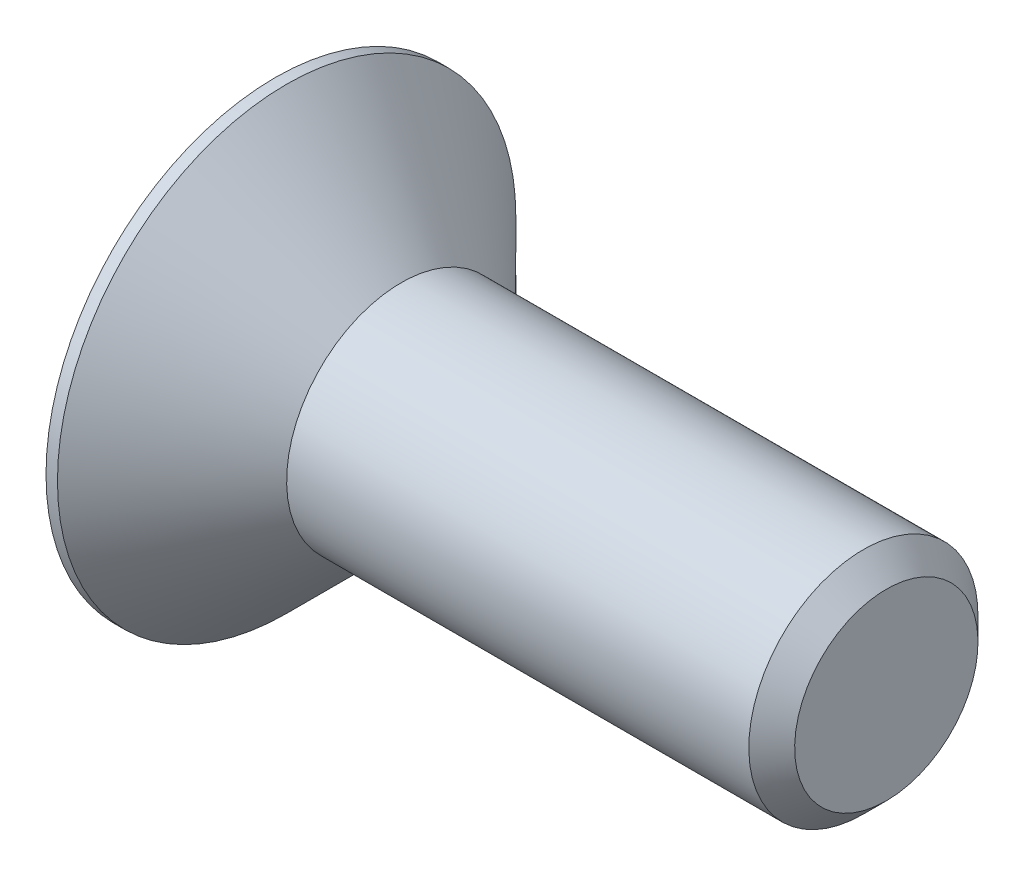
ISO-10303-21;
HEADER;
FILE_DESCRIPTION(('STEP AP214'),'2;1');
FILE_NAME('part.step','',(''),(''),'','','');
FILE_SCHEMA(('AUTOMOTIVE_DESIGN { 1 0 10303 214 1 1 1 1 }'));
ENDSEC;
DATA;
#1=APPLICATION_CONTEXT('core data for automotive mechanical design processes');
#2=APPLICATION_PROTOCOL_DEFINITION('international standard','automotive_design',2000,#1);
#3=PRODUCT_CONTEXT('',#1,'mechanical');
#4=PRODUCT('Part','Part','',(#3));
#5=PRODUCT_RELATED_PRODUCT_CATEGORY('part','',(#4));
#6=PRODUCT_DEFINITION_FORMATION('','',#4);
#7=PRODUCT_DEFINITION_CONTEXT('part definition',#1,'design');
#8=PRODUCT_DEFINITION('design','',#6,#7);
#9=PRODUCT_DEFINITION_SHAPE('','',#8);
#10=(LENGTH_UNIT() NAMED_UNIT(*) SI_UNIT(.MILLI.,.METRE.));
#11=(NAMED_UNIT(*) PLANE_ANGLE_UNIT() SI_UNIT($,.RADIAN.));
#12=(NAMED_UNIT(*) SI_UNIT($,.STERADIAN.) SOLID_ANGLE_UNIT());
#13=UNCERTAINTY_MEASURE_WITH_UNIT(LENGTH_MEASURE(1.E-05),#10,'distance_accuracy_value','');
#14=(GEOMETRIC_REPRESENTATION_CONTEXT(3) GLOBAL_UNCERTAINTY_ASSIGNED_CONTEXT((#13)) GLOBAL_UNIT_ASSIGNED_CONTEXT((#10,
#11,#12)) REPRESENTATION_CONTEXT('',''));
#15=CARTESIAN_POINT('',(0.,0.,0.));
#16=DIRECTION('',(0.,0.,1.));
#17=DIRECTION('',(1.,0.,0.));
#18=AXIS2_PLACEMENT_3D('',#15,#16,#17);
#19=CARTESIAN_POINT('',(1.65000000000121,32.4759533496223,18.7500003484413));
#20=DIRECTION('',(-1.,0.,0.));
#21=DIRECTION('',(0.,-1.,0.));
#22=AXIS2_PLACEMENT_3D('',#19,#20,#21);
#23=PLANE('',#22);
#24=DIRECTION('',(0.,0.5,-0.866025403784439));
#25=VECTOR('',#24,1.);
#26=CARTESIAN_POINT('',(1.65000000000113,30.7439025420534,17.7500003484413));
#27=LINE('',#26,#25);
#28=CARTESIAN_POINT('',(1.65000000000117,31.321252811243,16.7500003484413));
#29=VERTEX_POINT('',#28);
#30=CARTESIAN_POINT('',(1.65000000000106,30.1665522728638,18.7500003484413));
#31=VERTEX_POINT('',#30);
#32=EDGE_CURVE('E83',#29,#31,#27,.F.);
#33=ORIENTED_EDGE('',*,*,#32,.T.);
#34=DIRECTION('',(0.,-0.5,-0.866025403784439));
#35=VECTOR('',#34,1.);
#36=CARTESIAN_POINT('',(1.65000000000104,30.7439025420534,19.7500003484414));
#37=LINE('',#36,#35);
#38=CARTESIAN_POINT('',(1.65000000000111,31.3212528112431,20.7500003484413));
#39=VERTEX_POINT('',#38);
#40=EDGE_CURVE('E67',#31,#39,#37,.F.);
#41=ORIENTED_EDGE('',*,*,#40,.T.);
#42=DIRECTION('',(0.,-1.,0.));
#43=VECTOR('',#42,1.);
#44=CARTESIAN_POINT('',(1.65000000000113,32.4759533496224,20.7500003484413));
#45=LINE('',#44,#43);
#46=CARTESIAN_POINT('',(1.65000000000121,33.6306538880015,20.7500003484413));
#47=VERTEX_POINT('',#46);
#48=EDGE_CURVE('E72',#39,#47,#45,.F.);
#49=ORIENTED_EDGE('',*,*,#48,.T.);
#50=DIRECTION('',(0.,-0.5,0.866025403784439));
#51=VECTOR('',#50,1.);
#52=CARTESIAN_POINT('',(1.6500000000013,34.2080041571912,19.7500003484412));
#53=LINE('',#52,#51);
#54=CARTESIAN_POINT('',(1.65000000000137,34.7853544263808,18.7500003484413));
#55=VERTEX_POINT('',#54);
#56=EDGE_CURVE('E121',#47,#55,#53,.F.);
#57=ORIENTED_EDGE('',*,*,#56,.T.);
#58=DIRECTION('',(0.,0.5,0.866025403784439));
#59=VECTOR('',#58,1.);
#60=CARTESIAN_POINT('',(1.65000000000139,34.2080041571912,17.7500003484414));
#61=LINE('',#60,#59);
#62=CARTESIAN_POINT('',(1.65000000000132,33.6306538880016,16.7500003484413));
#63=VERTEX_POINT('',#62);
#64=EDGE_CURVE('E125',#55,#63,#61,.F.);
#65=ORIENTED_EDGE('',*,*,#64,.T.);
#66=DIRECTION('',(0.,1.,0.));
#67=VECTOR('',#66,1.);
#68=CARTESIAN_POINT('',(1.6500000000013,32.4759533496224,16.7500003484413));
#69=LINE('',#68,#67);
#70=EDGE_CURVE('E130',#63,#29,#69,.F.);
#71=ORIENTED_EDGE('',*,*,#70,.T.);
#72=EDGE_LOOP('',(#33,#41,#49,#57,#65,#71));
#73=FACE_BOUND('',#72,.T.);
#74=ADVANCED_FACE('F17',(#73),#23,.T.);
#75=CARTESIAN_POINT('',(1.21471452688149E-12,32.4759533496224,20.7500003484413));
#76=DIRECTION('',(0.,0.,1.));
#77=DIRECTION('',(0.,-1.,0.));
#78=AXIS2_PLACEMENT_3D('',#75,#76,#77);
#79=PLANE('',#78);
#80=DIRECTION('',(1.,0.,0.));
#81=VECTOR('',#80,1.);
#82=CARTESIAN_POINT('',(1.0856138949919E-12,31.3212528112431,20.7500003484412));
#83=LINE('',#82,#81);
#84=CARTESIAN_POINT('',(1.21471452688149E-12,31.3212528112431,20.7500003484413));
#85=VERTEX_POINT('',#84);
#86=EDGE_CURVE('E74',#39,#85,#83,.F.);
#87=ORIENTED_EDGE('',*,*,#86,.T.);
#88=DIRECTION('',(0.,-1.,0.));
#89=VECTOR('',#88,1.);
#90=CARTESIAN_POINT('',(1.21471452688149E-12,32.4759533496224,20.7500003484413));
#91=LINE('',#90,#89);
#92=CARTESIAN_POINT('',(1.32246166763666E-12,33.6306538880016,20.7500003484413));
#93=VERTEX_POINT('',#92);
#94=EDGE_CURVE('E119',#93,#85,#91,.T.);
#95=ORIENTED_EDGE('',*,*,#94,.F.);
#96=DIRECTION('',(1.,0.,0.));
#97=VECTOR('',#96,1.);
#98=CARTESIAN_POINT('',(1.34406008004185E-12,33.6306538880017,20.7500003484413));
#99=LINE('',#98,#97);
#100=EDGE_CURVE('E77',#93,#47,#99,.T.);
#101=ORIENTED_EDGE('',*,*,#100,.T.);
#102=ORIENTED_EDGE('',*,*,#48,.F.);
#103=EDGE_LOOP('',(#87,#95,#101,#102));
#104=FACE_BOUND('',#103,.T.);
#105=ADVANCED_FACE('F73',(#104),#79,.F.);
#106=CARTESIAN_POINT('',(1.0856138949919E-12,30.7439025420535,19.7500003484413));
#107=DIRECTION('',(0.,-0.866025403784439,0.5));
#108=DIRECTION('',(0.,-0.5,-0.866025403784439));
#109=AXIS2_PLACEMENT_3D('',#106,#107,#108);
#110=PLANE('',#109);
#111=DIRECTION('',(1.,0.,0.));
#112=VECTOR('',#111,1.);
#113=CARTESIAN_POINT('',(1.08585881626266E-12,30.1665522728639,18.7500003484413));
#114=LINE('',#113,#112);
#115=CARTESIAN_POINT('',(1.08561389499189E-12,30.1665522728639,18.7500003484413));
#116=VERTEX_POINT('',#115);
#117=EDGE_CURVE('E85',#31,#116,#114,.F.);
#118=ORIENTED_EDGE('',*,*,#117,.T.);
#119=DIRECTION('',(0.,-0.499999999999983,-0.866025403784448));
#120=VECTOR('',#119,1.);
#121=CARTESIAN_POINT('',(1.1285657985315E-12,31.3212528112431,20.7500003484413));
#122=LINE('',#121,#120);
#123=EDGE_CURVE('E89',#85,#116,#122,.T.);
#124=ORIENTED_EDGE('',*,*,#123,.F.);
#125=ORIENTED_EDGE('',*,*,#86,.F.);
#126=ORIENTED_EDGE('',*,*,#40,.F.);
#127=EDGE_LOOP('',(#118,#124,#125,#126));
#128=FACE_BOUND('',#127,.T.);
#129=ADVANCED_FACE('F87',(#128),#110,.F.);
#130=CARTESIAN_POINT('',(1.08585881626266E-12,30.7439025420535,17.7500003484413));
#131=DIRECTION('',(0.,-0.866025403784439,-0.5));
#132=DIRECTION('',(0.,0.5,-0.866025403784439));
#133=AXIS2_PLACEMENT_3D('',#130,#131,#132);
#134=PLANE('',#133);
#135=DIRECTION('',(1.,0.,0.));
#136=VECTOR('',#135,1.);
#137=CARTESIAN_POINT('',(1.21520436942302E-12,31.321252811243,16.7500003484413));
#138=LINE('',#137,#136);
#139=CARTESIAN_POINT('',(1.08585881626266E-12,31.3212528112431,16.7500003484413));
#140=VERTEX_POINT('',#139);
#141=EDGE_CURVE('E132',#29,#140,#138,.F.);
#142=ORIENTED_EDGE('',*,*,#141,.T.);
#143=DIRECTION('',(0.,0.499999999999984,-0.866025403784448));
#144=VECTOR('',#143,1.);
#145=CARTESIAN_POINT('',(1.04266199145229E-12,30.1665522728639,18.7500003484413));
#146=LINE('',#145,#144);
#147=EDGE_CURVE('E115',#116,#140,#146,.T.);
#148=ORIENTED_EDGE('',*,*,#147,.F.);
#149=ORIENTED_EDGE('',*,*,#117,.F.);
#150=ORIENTED_EDGE('',*,*,#32,.F.);
#151=EDGE_LOOP('',(#142,#148,#149,#150));
#152=FACE_BOUND('',#151,.T.);
#153=ADVANCED_FACE('F136',(#152),#134,.F.);
#154=CARTESIAN_POINT('',(1.21520436942302E-12,32.4759533496224,16.7500003484413));
#155=DIRECTION('',(0.,0.,-1.));
#156=DIRECTION('',(0.,1.,0.));
#157=AXIS2_PLACEMENT_3D('',#154,#155,#156);
#158=PLANE('',#157);
#159=DIRECTION('',(1.,0.,0.));
#160=VECTOR('',#159,1.);
#161=CARTESIAN_POINT('',(1.34430500131261E-12,33.6306538880016,16.7500003484412));
#162=LINE('',#161,#160);
#163=CARTESIAN_POINT('',(1.21520436942302E-12,33.6306538880017,16.7500003484413));
#164=VERTEX_POINT('',#163);
#165=EDGE_CURVE('E128',#63,#164,#162,.F.);
#166=ORIENTED_EDGE('',*,*,#165,.T.);
#167=DIRECTION('',(0.,-1.,0.));
#168=VECTOR('',#167,1.);
#169=CARTESIAN_POINT('',(1.21520436942302E-12,32.4759533496224,16.7500003484413));
#170=LINE('',#169,#168);
#171=EDGE_CURVE('E109',#140,#164,#170,.F.);
#172=ORIENTED_EDGE('',*,*,#171,.F.);
#173=ORIENTED_EDGE('',*,*,#141,.F.);
#174=ORIENTED_EDGE('',*,*,#70,.F.);
#175=EDGE_LOOP('',(#166,#172,#173,#174));
#176=FACE_BOUND('',#175,.T.);
#177=ADVANCED_FACE('F145',(#176),#158,.F.);
#178=CARTESIAN_POINT('',(1.34430500131261E-12,34.2080041571913,17.7500003484413));
#179=DIRECTION('',(0.,0.866025403784439,-0.5));
#180=DIRECTION('',(0.,0.5,0.866025403784439));
#181=AXIS2_PLACEMENT_3D('',#178,#179,#180);
#182=PLANE('',#181);
#183=DIRECTION('',(1.,0.,0.));
#184=VECTOR('',#183,1.);
#185=CARTESIAN_POINT('',(1.34406008004185E-12,34.7853544263809,18.7500003484414));
#186=LINE('',#185,#184);
#187=CARTESIAN_POINT('',(1.34430500131261E-12,34.7853544263809,18.7500003484413));
#188=VERTEX_POINT('',#187);
#189=EDGE_CURVE('E35',#55,#188,#186,.F.);
#190=ORIENTED_EDGE('',*,*,#189,.T.);
#191=DIRECTION('',(0.,0.499999999999983,0.866025403784449));
#192=VECTOR('',#191,1.);
#193=CARTESIAN_POINT('',(1.301353097773E-12,33.6306538880017,16.7500003484413));
#194=LINE('',#193,#192);
#195=EDGE_CURVE('E105',#164,#188,#194,.T.);
#196=ORIENTED_EDGE('',*,*,#195,.F.);
#197=ORIENTED_EDGE('',*,*,#165,.F.);
#198=ORIENTED_EDGE('',*,*,#64,.F.);
#199=EDGE_LOOP('',(#190,#196,#197,#198));
#200=FACE_BOUND('',#199,.T.);
#201=ADVANCED_FACE('F143',(#200),#182,.F.);
#202=CARTESIAN_POINT('',(1.34406008004185E-12,34.2080041571913,19.7500003484413));
#203=DIRECTION('',(0.,0.866025403784439,0.5));
#204=DIRECTION('',(0.,-0.5,0.866025403784439));
#205=AXIS2_PLACEMENT_3D('',#202,#203,#204);
#206=PLANE('',#205);
#207=ORIENTED_EDGE('',*,*,#100,.F.);
#208=DIRECTION('',(0.,-0.499999999999982,0.866025403784449));
#209=VECTOR('',#208,1.);
#210=CARTESIAN_POINT('',(1.38725690485222E-12,34.7853544263809,18.7500003484413));
#211=LINE('',#210,#209);
#212=EDGE_CURVE('E101',#188,#93,#211,.T.);
#213=ORIENTED_EDGE('',*,*,#212,.F.);
#214=ORIENTED_EDGE('',*,*,#189,.F.);
#215=ORIENTED_EDGE('',*,*,#56,.F.);
#216=EDGE_LOOP('',(#207,#213,#214,#215));
#217=FACE_BOUND('',#216,.T.);
#218=ADVANCED_FACE('F141',(#217),#206,.F.);
#219=CARTESIAN_POINT('',(1.2153268300584E-12,32.4759533496224,15.7500003484413));
#220=DIRECTION('',(-1.,0.,0.));
#221=DIRECTION('',(0.,-1.,0.));
#222=AXIS2_PLACEMENT_3D('',#219,#220,#221);
#223=PLANE('',#222);
#224=CARTESIAN_POINT('',(1.21503826965019E-12,32.4759533496224,18.7500003484413));
#225=DIRECTION('',(-1.,0.,0.));
#226=DIRECTION('',(0.,-1.,0.));
#227=AXIS2_PLACEMENT_3D('',#224,#225,#226);
#228=CIRCLE('',#227,6.);
#229=CARTESIAN_POINT('',(7.6739634612133E-13,26.4759533496224,18.7500003484413));
#230=VERTEX_POINT('',#229);
#231=EDGE_CURVE('E20',#230,#230,#228,.F.);
#232=ORIENTED_EDGE('',*,*,#231,.F.);
#233=EDGE_LOOP('',(#232));
#234=FACE_BOUND('',#233,.T.);
#235=ORIENTED_EDGE('',*,*,#195,.T.);
#236=ORIENTED_EDGE('',*,*,#212,.T.);
#237=ORIENTED_EDGE('',*,*,#94,.T.);
#238=ORIENTED_EDGE('',*,*,#123,.T.);
#239=ORIENTED_EDGE('',*,*,#147,.T.);
#240=ORIENTED_EDGE('',*,*,#171,.T.);
#241=EDGE_LOOP('',(#235,#236,#237,#238,#239,#240));
#242=FACE_BOUND('',#241,.T.);
#243=ADVANCED_FACE('F139',(#234,#242),#223,.T.);
#244=CARTESIAN_POINT('',(16.0000000000012,32.4759533496212,17.2500003484414));
#245=DIRECTION('',(1.,0.,0.));
#246=DIRECTION('',(0.,1.,0.));
#247=AXIS2_PLACEMENT_3D('',#244,#245,#246);
#248=PLANE('',#247);
#249=CARTESIAN_POINT('',(16.0000000000196,32.4759533496212,18.7500003484413));
#250=DIRECTION('',(-1.,0.,0.));
#251=DIRECTION('',(0.,-1.,0.));
#252=AXIS2_PLACEMENT_3D('',#249,#250,#251);
#253=CIRCLE('',#252,2.39999999998621);
#254=CARTESIAN_POINT('',(16.0000000000194,30.075953349635,18.7500003484413));
#255=VERTEX_POINT('',#254);
#256=EDGE_CURVE('E96',#255,#255,#253,.T.);
#257=ORIENTED_EDGE('',*,*,#256,.F.);
#258=EDGE_LOOP('',(#257));
#259=FACE_BOUND('',#258,.T.);
#260=ADVANCED_FACE('F175',(#259),#248,.T.);
#261=CARTESIAN_POINT('',(0.150000000001216,32.4759533496224,18.7500003484413));
#262=DIRECTION('',(-1.,0.,0.));
#263=DIRECTION('',(0.,-1.,0.));
#264=AXIS2_PLACEMENT_3D('',#261,#262,#263);
#265=CYLINDRICAL_SURFACE('',#264,6.);
#266=ORIENTED_EDGE('',*,*,#231,.T.);
#267=EDGE_LOOP('',(#266));
#268=FACE_BOUND('',#267,.T.);
#269=CARTESIAN_POINT('',(0.299999999924693,32.4759533496224,18.7500003484413));
#270=DIRECTION('',(-1.,0.,0.));
#271=DIRECTION('',(0.,0.,-1.));
#272=AXIS2_PLACEMENT_3D('',#269,#270,#271);
#273=CIRCLE('',#272,6.00000000000842);
#274=CARTESIAN_POINT('',(0.299999999924694,32.4759533496224,12.7500003484329));
#275=VERTEX_POINT('',#274);
#276=EDGE_CURVE('E94',#275,#275,#273,.F.);
#277=ORIENTED_EDGE('',*,*,#276,.F.);
#278=EDGE_LOOP('',(#277));
#279=FACE_BOUND('',#278,.T.);
#280=ADVANCED_FACE('F171',(#268,#279),#265,.T.);
#281=CARTESIAN_POINT('',(15.3999999999996,32.4759533496212,18.7500003484413));
#282=DIRECTION('',(-1.,0.,0.));
#283=DIRECTION('',(0.,-1.,0.));
#284=AXIS2_PLACEMENT_3D('',#281,#282,#283);
#285=CONICAL_SURFACE('',#284,3.00000000000613,0.785398163397447);
#286=CARTESIAN_POINT('',(15.4000000000012,32.4759533496213,18.7500003484413));
#287=DIRECTION('',(-1.,0.,0.));
#288=DIRECTION('',(0.,-1.,0.));
#289=AXIS2_PLACEMENT_3D('',#286,#287,#288);
#290=CIRCLE('',#289,3.);
#291=CARTESIAN_POINT('',(15.400000000001,29.4759533496213,18.7500003484413));
#292=VERTEX_POINT('',#291);
#293=EDGE_CURVE('E26',#292,#292,#290,.T.);
#294=ORIENTED_EDGE('',*,*,#293,.F.);
#295=EDGE_LOOP('',(#294));
#296=FACE_BOUND('',#295,.T.);
#297=ORIENTED_EDGE('',*,*,#256,.T.);
#298=EDGE_LOOP('',(#297));
#299=FACE_BOUND('',#298,.T.);
#300=ADVANCED_FACE('F163',(#296,#299),#285,.T.);
#301=CARTESIAN_POINT('',(0.299999999924693,32.4759533496224,18.7500003484413));
#302=DIRECTION('',(-1.,0.,0.));
#303=DIRECTION('',(0.,-1.,0.));
#304=AXIS2_PLACEMENT_3D('',#301,#302,#303);
#305=CONICAL_SURFACE('',#304,6.00000000000842,0.785398163397448);
#306=CARTESIAN_POINT('',(3.30000000000122,32.4759533496222,18.7500003484413));
#307=DIRECTION('',(-1.,0.,0.));
#308=DIRECTION('',(0.,-1.,0.));
#309=AXIS2_PLACEMENT_3D('',#306,#307,#308);
#310=CIRCLE('',#309,3.);
#311=CARTESIAN_POINT('',(3.300000000001,29.4759533496222,18.7500003484413));
#312=VERTEX_POINT('',#311);
#313=EDGE_CURVE('E11',#312,#312,#310,.F.);
#314=ORIENTED_EDGE('',*,*,#313,.F.);
#315=EDGE_LOOP('',(#314));
#316=FACE_BOUND('',#315,.T.);
#317=ORIENTED_EDGE('',*,*,#276,.T.);
#318=EDGE_LOOP('',(#317));
#319=FACE_BOUND('',#318,.T.);
#320=ADVANCED_FACE('F157',(#316,#319),#305,.T.);
#321=CARTESIAN_POINT('',(9.65000000000121,32.4759533496217,18.7500003484413));
#322=DIRECTION('',(-1.,0.,0.));
#323=DIRECTION('',(0.,-1.,0.));
#324=AXIS2_PLACEMENT_3D('',#321,#322,#323);
#325=CYLINDRICAL_SURFACE('',#324,3.);
#326=ORIENTED_EDGE('',*,*,#293,.T.);
#327=EDGE_LOOP('',(#326));
#328=FACE_BOUND('',#327,.T.);
#329=ORIENTED_EDGE('',*,*,#313,.T.);
#330=EDGE_LOOP('',(#329));
#331=FACE_BOUND('',#330,.T.);
#332=ADVANCED_FACE('F155',(#328,#331),#325,.T.);
#333=CLOSED_SHELL('',(#74,#105,#129,#153,#177,#201,#218,#243,#260,#280,#300,#320,#332));
#334=MANIFOLD_SOLID_BREP('B1',#333);
#335=ADVANCED_BREP_SHAPE_REPRESENTATION('',(#18,#334),#14);
#336=SHAPE_DEFINITION_REPRESENTATION(#9,#335);
ENDSEC;
END-ISO-10303-21;
